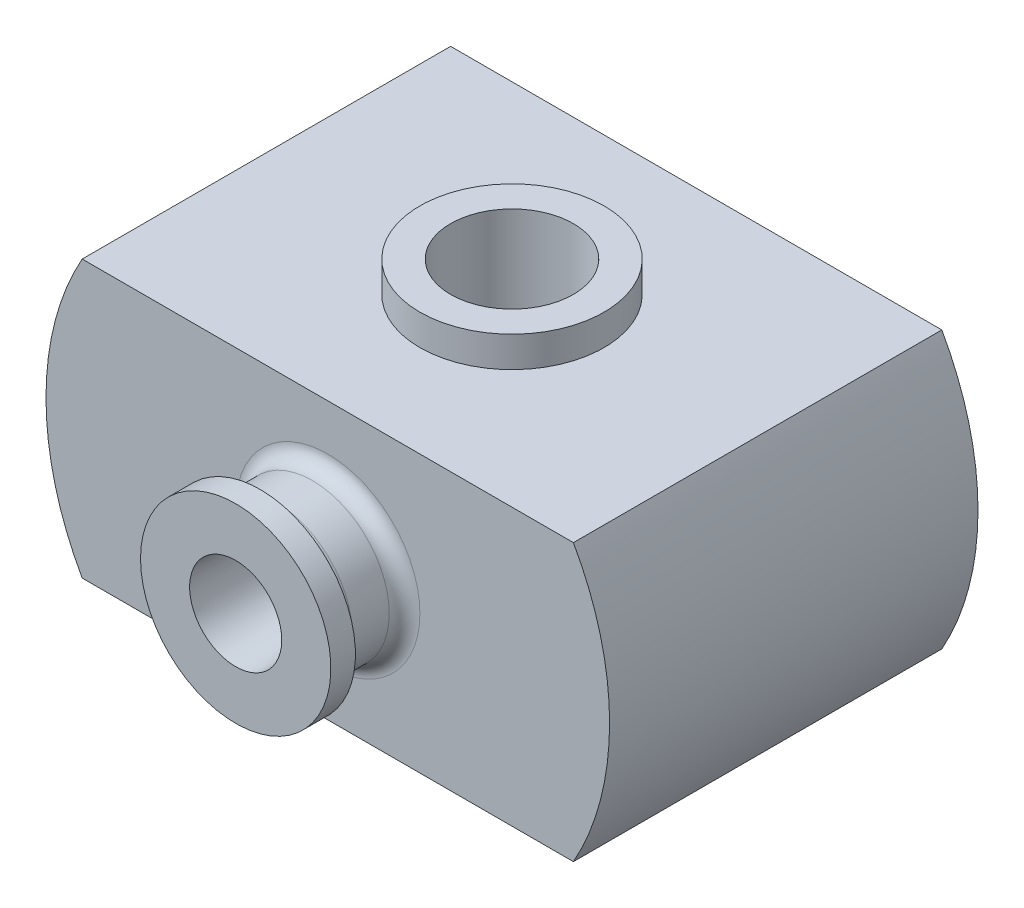
ISO-10303-21;
HEADER;
FILE_DESCRIPTION(('STEP AP214'),'2;1');
FILE_NAME('part.step','',(''),(''),'','','');
FILE_SCHEMA(('AUTOMOTIVE_DESIGN { 1 0 10303 214 1 1 1 1 }'));
ENDSEC;
DATA;
#1=APPLICATION_CONTEXT('core data for automotive mechanical design processes');
#2=APPLICATION_PROTOCOL_DEFINITION('international standard','automotive_design',2000,#1);
#3=PRODUCT_CONTEXT('',#1,'mechanical');
#4=PRODUCT('Part','Part','',(#3));
#5=PRODUCT_RELATED_PRODUCT_CATEGORY('part','',(#4));
#6=PRODUCT_DEFINITION_FORMATION('','',#4);
#7=PRODUCT_DEFINITION_CONTEXT('part definition',#1,'design');
#8=PRODUCT_DEFINITION('design','',#6,#7);
#9=PRODUCT_DEFINITION_SHAPE('','',#8);
#10=(LENGTH_UNIT() NAMED_UNIT(*) SI_UNIT(.MILLI.,.METRE.));
#11=(NAMED_UNIT(*) PLANE_ANGLE_UNIT() SI_UNIT($,.RADIAN.));
#12=(NAMED_UNIT(*) SI_UNIT($,.STERADIAN.) SOLID_ANGLE_UNIT());
#13=UNCERTAINTY_MEASURE_WITH_UNIT(LENGTH_MEASURE(1.E-05),#10,'distance_accuracy_value','');
#14=(GEOMETRIC_REPRESENTATION_CONTEXT(3) GLOBAL_UNCERTAINTY_ASSIGNED_CONTEXT((#13)) GLOBAL_UNIT_ASSIGNED_CONTEXT((#10,
#11,#12)) REPRESENTATION_CONTEXT('',''));
#15=CARTESIAN_POINT('',(0.,0.,0.));
#16=DIRECTION('',(0.,0.,1.));
#17=DIRECTION('',(1.,0.,0.));
#18=AXIS2_PLACEMENT_3D('',#15,#16,#17);
#19=CARTESIAN_POINT('',(-80.,45.,120.));
#20=DIRECTION('',(0.,-1.,0.));
#21=DIRECTION('',(0.,0.,-1.));
#22=AXIS2_PLACEMENT_3D('',#19,#20,#21);
#23=PLANE('',#22);
#24=DIRECTION('',(-1.,0.,0.));
#25=VECTOR('',#24,1.);
#26=CARTESIAN_POINT('',(-80.,45.,0.));
#27=LINE('',#26,#25);
#28=CARTESIAN_POINT('',(80.,45.,0.));
#29=VERTEX_POINT('',#28);
#30=CARTESIAN_POINT('',(-80.,45.,0.));
#31=VERTEX_POINT('',#30);
#32=EDGE_CURVE('E168',#29,#31,#27,.T.);
#33=ORIENTED_EDGE('',*,*,#32,.T.);
#34=DIRECTION('',(0.,0.,-1.));
#35=VECTOR('',#34,1.);
#36=CARTESIAN_POINT('',(-80.,45.,120.));
#37=LINE('',#36,#35);
#38=CARTESIAN_POINT('',(-80.,45.,120.));
#39=VERTEX_POINT('',#38);
#40=EDGE_CURVE('E176',#39,#31,#37,.T.);
#41=ORIENTED_EDGE('',*,*,#40,.F.);
#42=DIRECTION('',(-1.,0.,0.));
#43=VECTOR('',#42,1.);
#44=CARTESIAN_POINT('',(-80.,45.,120.));
#45=LINE('',#44,#43);
#46=CARTESIAN_POINT('',(80.,45.,120.));
#47=VERTEX_POINT('',#46);
#48=EDGE_CURVE('E93',#47,#39,#45,.T.);
#49=ORIENTED_EDGE('',*,*,#48,.F.);
#50=DIRECTION('',(0.,0.,-1.));
#51=VECTOR('',#50,1.);
#52=CARTESIAN_POINT('',(80.,45.,120.));
#53=LINE('',#52,#51);
#54=EDGE_CURVE('E179',#47,#29,#53,.T.);
#55=ORIENTED_EDGE('',*,*,#54,.T.);
#56=EDGE_LOOP('',(#33,#41,#49,#55));
#57=FACE_BOUND('',#56,.T.);
#58=CARTESIAN_POINT('',(0.,45.,60.));
#59=DIRECTION('',(0.,-1.,0.));
#60=DIRECTION('',(0.,0.,-1.));
#61=AXIS2_PLACEMENT_3D('',#58,#59,#60);
#62=CIRCLE('',#61,30.);
#63=CARTESIAN_POINT('',(0.,45.,30.));
#64=VERTEX_POINT('',#63);
#65=EDGE_CURVE('E142',#64,#64,#62,.F.);
#66=ORIENTED_EDGE('',*,*,#65,.F.);
#67=EDGE_LOOP('',(#66));
#68=FACE_BOUND('',#67,.T.);
#69=ADVANCED_FACE('F40',(#57,#68),#23,.F.);
#70=CARTESIAN_POINT('',(60.,30.,114.));
#71=DIRECTION('',(0.,1.,0.));
#72=DIRECTION('',(-1.,0.,0.));
#73=AXIS2_PLACEMENT_3D('',#70,#71,#72);
#74=PLANE('',#73);
#75=DIRECTION('',(1.,0.,0.));
#76=VECTOR('',#75,1.);
#77=CARTESIAN_POINT('',(60.,30.,0.));
#78=LINE('',#77,#76);
#79=CARTESIAN_POINT('',(-60.,30.,0.));
#80=VERTEX_POINT('',#79);
#81=CARTESIAN_POINT('',(60.,30.,0.));
#82=VERTEX_POINT('',#81);
#83=EDGE_CURVE('E148',#80,#82,#78,.T.);
#84=ORIENTED_EDGE('',*,*,#83,.T.);
#85=DIRECTION('',(0.,0.,-1.));
#86=VECTOR('',#85,1.);
#87=CARTESIAN_POINT('',(60.,30.,114.));
#88=LINE('',#87,#86);
#89=CARTESIAN_POINT('',(60.,30.,114.));
#90=VERTEX_POINT('',#89);
#91=EDGE_CURVE('E122',#90,#82,#88,.T.);
#92=ORIENTED_EDGE('',*,*,#91,.F.);
#93=DIRECTION('',(1.,0.,0.));
#94=VECTOR('',#93,1.);
#95=CARTESIAN_POINT('',(60.,30.,114.));
#96=LINE('',#95,#94);
#97=CARTESIAN_POINT('',(-60.,30.,114.));
#98=VERTEX_POINT('',#97);
#99=EDGE_CURVE('E126',#98,#90,#96,.T.);
#100=ORIENTED_EDGE('',*,*,#99,.F.);
#101=DIRECTION('',(0.,0.,-1.));
#102=VECTOR('',#101,1.);
#103=CARTESIAN_POINT('',(-60.,30.,114.));
#104=LINE('',#103,#102);
#105=EDGE_CURVE('E113',#98,#80,#104,.T.);
#106=ORIENTED_EDGE('',*,*,#105,.T.);
#107=EDGE_LOOP('',(#84,#92,#100,#106));
#108=FACE_BOUND('',#107,.T.);
#109=CARTESIAN_POINT('',(0.,30.,60.));
#110=DIRECTION('',(0.,1.,0.));
#111=DIRECTION('',(-1.,0.,0.));
#112=AXIS2_PLACEMENT_3D('',#109,#110,#111);
#113=CIRCLE('',#112,30.);
#114=CARTESIAN_POINT('',(-30.,30.,60.));
#115=VERTEX_POINT('',#114);
#116=EDGE_CURVE('E181',#115,#115,#113,.F.);
#117=ORIENTED_EDGE('',*,*,#116,.F.);
#118=EDGE_LOOP('',(#117));
#119=FACE_BOUND('',#118,.T.);
#120=ADVANCED_FACE('F127',(#108,#119),#74,.F.);
#121=CARTESIAN_POINT('',(0.,0.,120.));
#122=DIRECTION('',(0.,0.,-1.));
#123=DIRECTION('',(-1.,0.,0.));
#124=AXIS2_PLACEMENT_3D('',#121,#122,#123);
#125=CYLINDRICAL_SURFACE('',#124,91.7877987534291);
#126=CARTESIAN_POINT('',(0.,0.,0.));
#127=DIRECTION('',(0.,0.,1.));
#128=DIRECTION('',(1.,0.,0.));
#129=AXIS2_PLACEMENT_3D('',#126,#127,#128);
#130=CIRCLE('',#129,91.7877987534291);
#131=CARTESIAN_POINT('',(80.,-45.,0.));
#132=VERTEX_POINT('',#131);
#133=EDGE_CURVE('E155',#132,#29,#130,.T.);
#134=ORIENTED_EDGE('',*,*,#133,.T.);
#135=ORIENTED_EDGE('',*,*,#54,.F.);
#136=CARTESIAN_POINT('',(0.,0.,120.));
#137=DIRECTION('',(0.,0.,1.));
#138=DIRECTION('',(1.,0.,0.));
#139=AXIS2_PLACEMENT_3D('',#136,#137,#138);
#140=CIRCLE('',#139,91.7877987534291);
#141=CARTESIAN_POINT('',(80.,-45.,120.));
#142=VERTEX_POINT('',#141);
#143=EDGE_CURVE('E159',#142,#47,#140,.T.);
#144=ORIENTED_EDGE('',*,*,#143,.F.);
#145=DIRECTION('',(0.,0.,-1.));
#146=VECTOR('',#145,1.);
#147=CARTESIAN_POINT('',(80.,-45.,120.));
#148=LINE('',#147,#146);
#149=EDGE_CURVE('E165',#142,#132,#148,.T.);
#150=ORIENTED_EDGE('',*,*,#149,.T.);
#151=EDGE_LOOP('',(#134,#135,#144,#150));
#152=FACE_BOUND('',#151,.T.);
#153=ADVANCED_FACE('F221',(#152),#125,.T.);
#154=CARTESIAN_POINT('',(0.,0.,120.));
#155=DIRECTION('',(0.,0.,-1.));
#156=DIRECTION('',(-1.,0.,0.));
#157=AXIS2_PLACEMENT_3D('',#154,#155,#156);
#158=CYLINDRICAL_SURFACE('',#157,91.7877987534291);
#159=CARTESIAN_POINT('',(0.,0.,0.));
#160=DIRECTION('',(0.,0.,1.));
#161=DIRECTION('',(1.,0.,0.));
#162=AXIS2_PLACEMENT_3D('',#159,#160,#161);
#163=CIRCLE('',#162,91.7877987534291);
#164=CARTESIAN_POINT('',(-80.,-45.,0.));
#165=VERTEX_POINT('',#164);
#166=EDGE_CURVE('E170',#31,#165,#163,.T.);
#167=ORIENTED_EDGE('',*,*,#166,.T.);
#168=DIRECTION('',(0.,0.,-1.));
#169=VECTOR('',#168,1.);
#170=CARTESIAN_POINT('',(-80.,-45.,120.));
#171=LINE('',#170,#169);
#172=CARTESIAN_POINT('',(-80.,-45.,120.));
#173=VERTEX_POINT('',#172);
#174=EDGE_CURVE('E174',#173,#165,#171,.T.);
#175=ORIENTED_EDGE('',*,*,#174,.F.);
#176=CARTESIAN_POINT('',(0.,0.,120.));
#177=DIRECTION('',(0.,0.,1.));
#178=DIRECTION('',(1.,0.,0.));
#179=AXIS2_PLACEMENT_3D('',#176,#177,#178);
#180=CIRCLE('',#179,91.7877987534291);
#181=EDGE_CURVE('E162',#39,#173,#180,.T.);
#182=ORIENTED_EDGE('',*,*,#181,.F.);
#183=ORIENTED_EDGE('',*,*,#40,.T.);
#184=EDGE_LOOP('',(#167,#175,#182,#183));
#185=FACE_BOUND('',#184,.T.);
#186=ADVANCED_FACE('F226',(#185),#158,.T.);
#187=CARTESIAN_POINT('',(-80.,-45.,120.));
#188=DIRECTION('',(0.,1.,0.));
#189=DIRECTION('',(0.,0.,1.));
#190=AXIS2_PLACEMENT_3D('',#187,#188,#189);
#191=PLANE('',#190);
#192=CARTESIAN_POINT('',(0.,-45.,60.));
#193=DIRECTION('',(0.,1.,0.));
#194=DIRECTION('',(0.,0.,1.));
#195=AXIS2_PLACEMENT_3D('',#192,#193,#194);
#196=CIRCLE('',#195,30.);
#197=CARTESIAN_POINT('',(0.,-45.,90.));
#198=VERTEX_POINT('',#197);
#199=EDGE_CURVE('E187',#198,#198,#196,.T.);
#200=ORIENTED_EDGE('',*,*,#199,.T.);
#201=EDGE_LOOP('',(#200));
#202=FACE_BOUND('',#201,.T.);
#203=DIRECTION('',(1.,0.,0.));
#204=VECTOR('',#203,1.);
#205=CARTESIAN_POINT('',(-80.,-45.,0.));
#206=LINE('',#205,#204);
#207=EDGE_CURVE('E85',#165,#132,#206,.T.);
#208=ORIENTED_EDGE('',*,*,#207,.T.);
#209=ORIENTED_EDGE('',*,*,#149,.F.);
#210=DIRECTION('',(1.,0.,0.));
#211=VECTOR('',#210,1.);
#212=CARTESIAN_POINT('',(-80.,-45.,120.));
#213=LINE('',#212,#211);
#214=EDGE_CURVE('E64',#173,#142,#213,.T.);
#215=ORIENTED_EDGE('',*,*,#214,.F.);
#216=ORIENTED_EDGE('',*,*,#174,.T.);
#217=EDGE_LOOP('',(#208,#209,#215,#216));
#218=FACE_BOUND('',#217,.T.);
#219=ADVANCED_FACE('F233',(#202,#218),#191,.F.);
#220=CARTESIAN_POINT('',(0.,0.,120.));
#221=DIRECTION('',(0.,0.,1.));
#222=DIRECTION('',(1.,0.,0.));
#223=AXIS2_PLACEMENT_3D('',#220,#221,#222);
#224=PLANE('',#223);
#225=CARTESIAN_POINT('',(0.,0.,120.));
#226=DIRECTION('',(0.,0.,1.));
#227=DIRECTION('',(1.,0.,0.));
#228=AXIS2_PLACEMENT_3D('',#225,#226,#227);
#229=CIRCLE('',#228,30.);
#230=CARTESIAN_POINT('',(30.,0.,120.));
#231=VERTEX_POINT('',#230);
#232=EDGE_CURVE('E189',#231,#231,#229,.F.);
#233=ORIENTED_EDGE('',*,*,#232,.T.);
#234=EDGE_LOOP('',(#233));
#235=FACE_BOUND('',#234,.T.);
#236=ORIENTED_EDGE('',*,*,#143,.T.);
#237=ORIENTED_EDGE('',*,*,#48,.T.);
#238=ORIENTED_EDGE('',*,*,#181,.T.);
#239=ORIENTED_EDGE('',*,*,#214,.T.);
#240=EDGE_LOOP('',(#236,#237,#238,#239));
#241=FACE_BOUND('',#240,.T.);
#242=ADVANCED_FACE('F243',(#235,#241),#224,.T.);
#243=CARTESIAN_POINT('',(0.,0.,0.));
#244=DIRECTION('',(0.,0.,1.));
#245=DIRECTION('',(1.,0.,0.));
#246=AXIS2_PLACEMENT_3D('',#243,#244,#245);
#247=PLANE('',#246);
#248=ORIENTED_EDGE('',*,*,#83,.F.);
#249=CARTESIAN_POINT('',(0.,0.,0.));
#250=DIRECTION('',(0.,0.,-1.));
#251=DIRECTION('',(-1.,0.,0.));
#252=AXIS2_PLACEMENT_3D('',#249,#250,#251);
#253=CIRCLE('',#252,67.0820393249937);
#254=CARTESIAN_POINT('',(-60.,-30.,0.));
#255=VERTEX_POINT('',#254);
#256=EDGE_CURVE('E55',#255,#80,#253,.T.);
#257=ORIENTED_EDGE('',*,*,#256,.F.);
#258=DIRECTION('',(-1.,0.,0.));
#259=VECTOR('',#258,1.);
#260=CARTESIAN_POINT('',(60.,-30.,0.));
#261=LINE('',#260,#259);
#262=CARTESIAN_POINT('',(60.,-30.,0.));
#263=VERTEX_POINT('',#262);
#264=EDGE_CURVE('E136',#263,#255,#261,.T.);
#265=ORIENTED_EDGE('',*,*,#264,.F.);
#266=CARTESIAN_POINT('',(0.,0.,0.));
#267=DIRECTION('',(0.,0.,-1.));
#268=DIRECTION('',(-1.,0.,0.));
#269=AXIS2_PLACEMENT_3D('',#266,#267,#268);
#270=CIRCLE('',#269,67.0820393249937);
#271=EDGE_CURVE('E139',#82,#263,#270,.T.);
#272=ORIENTED_EDGE('',*,*,#271,.F.);
#273=EDGE_LOOP('',(#248,#257,#265,#272));
#274=FACE_BOUND('',#273,.T.);
#275=ORIENTED_EDGE('',*,*,#133,.F.);
#276=ORIENTED_EDGE('',*,*,#207,.F.);
#277=ORIENTED_EDGE('',*,*,#166,.F.);
#278=ORIENTED_EDGE('',*,*,#32,.F.);
#279=EDGE_LOOP('',(#275,#276,#277,#278));
#280=FACE_BOUND('',#279,.T.);
#281=ADVANCED_FACE('F239',(#274,#280),#247,.F.);
#282=CARTESIAN_POINT('',(0.,0.,114.));
#283=DIRECTION('',(0.,0.,-1.));
#284=DIRECTION('',(-1.,0.,0.));
#285=AXIS2_PLACEMENT_3D('',#282,#283,#284);
#286=CYLINDRICAL_SURFACE('',#285,67.0820393249937);
#287=ORIENTED_EDGE('',*,*,#256,.T.);
#288=ORIENTED_EDGE('',*,*,#105,.F.);
#289=CARTESIAN_POINT('',(0.,0.,114.));
#290=DIRECTION('',(0.,0.,-1.));
#291=DIRECTION('',(-1.,0.,0.));
#292=AXIS2_PLACEMENT_3D('',#289,#290,#291);
#293=CIRCLE('',#292,67.0820393249937);
#294=CARTESIAN_POINT('',(-60.,-30.,114.));
#295=VERTEX_POINT('',#294);
#296=EDGE_CURVE('E117',#295,#98,#293,.T.);
#297=ORIENTED_EDGE('',*,*,#296,.F.);
#298=DIRECTION('',(0.,0.,-1.));
#299=VECTOR('',#298,1.);
#300=CARTESIAN_POINT('',(-60.,-30.,114.));
#301=LINE('',#300,#299);
#302=EDGE_CURVE('E153',#295,#255,#301,.T.);
#303=ORIENTED_EDGE('',*,*,#302,.T.);
#304=EDGE_LOOP('',(#287,#288,#297,#303));
#305=FACE_BOUND('',#304,.T.);
#306=ADVANCED_FACE('F115',(#305),#286,.F.);
#307=CARTESIAN_POINT('',(60.,-30.,114.));
#308=DIRECTION('',(0.,-1.,0.));
#309=DIRECTION('',(0.,0.,-1.));
#310=AXIS2_PLACEMENT_3D('',#307,#308,#309);
#311=PLANE('',#310);
#312=CARTESIAN_POINT('',(0.,-30.,60.));
#313=DIRECTION('',(0.,-1.,0.));
#314=DIRECTION('',(0.,0.,-1.));
#315=AXIS2_PLACEMENT_3D('',#312,#313,#314);
#316=CIRCLE('',#315,30.);
#317=CARTESIAN_POINT('',(0.,-30.,30.));
#318=VERTEX_POINT('',#317);
#319=EDGE_CURVE('E184',#318,#318,#316,.T.);
#320=ORIENTED_EDGE('',*,*,#319,.T.);
#321=EDGE_LOOP('',(#320));
#322=FACE_BOUND('',#321,.T.);
#323=ORIENTED_EDGE('',*,*,#264,.T.);
#324=ORIENTED_EDGE('',*,*,#302,.F.);
#325=DIRECTION('',(-1.,0.,0.));
#326=VECTOR('',#325,1.);
#327=CARTESIAN_POINT('',(60.,-30.,114.));
#328=LINE('',#327,#326);
#329=CARTESIAN_POINT('',(60.,-30.,114.));
#330=VERTEX_POINT('',#329);
#331=EDGE_CURVE('E123',#330,#295,#328,.T.);
#332=ORIENTED_EDGE('',*,*,#331,.F.);
#333=DIRECTION('',(0.,0.,-1.));
#334=VECTOR('',#333,1.);
#335=CARTESIAN_POINT('',(60.,-30.,114.));
#336=LINE('',#335,#334);
#337=EDGE_CURVE('E156',#330,#263,#336,.T.);
#338=ORIENTED_EDGE('',*,*,#337,.T.);
#339=EDGE_LOOP('',(#323,#324,#332,#338));
#340=FACE_BOUND('',#339,.T.);
#341=ADVANCED_FACE('F257',(#322,#340),#311,.F.);
#342=CARTESIAN_POINT('',(0.,0.,114.));
#343=DIRECTION('',(0.,0.,-1.));
#344=DIRECTION('',(-1.,0.,0.));
#345=AXIS2_PLACEMENT_3D('',#342,#343,#344);
#346=CYLINDRICAL_SURFACE('',#345,67.0820393249937);
#347=ORIENTED_EDGE('',*,*,#271,.T.);
#348=ORIENTED_EDGE('',*,*,#337,.F.);
#349=CARTESIAN_POINT('',(0.,0.,114.));
#350=DIRECTION('',(0.,0.,-1.));
#351=DIRECTION('',(-1.,0.,0.));
#352=AXIS2_PLACEMENT_3D('',#349,#350,#351);
#353=CIRCLE('',#352,67.0820393249937);
#354=EDGE_CURVE('E132',#90,#330,#353,.T.);
#355=ORIENTED_EDGE('',*,*,#354,.F.);
#356=ORIENTED_EDGE('',*,*,#91,.T.);
#357=EDGE_LOOP('',(#347,#348,#355,#356));
#358=FACE_BOUND('',#357,.T.);
#359=ADVANCED_FACE('F259',(#358),#346,.F.);
#360=CARTESIAN_POINT('',(0.,0.,114.));
#361=DIRECTION('',(0.,0.,-1.));
#362=DIRECTION('',(-1.,0.,0.));
#363=AXIS2_PLACEMENT_3D('',#360,#361,#362);
#364=PLANE('',#363);
#365=CARTESIAN_POINT('',(0.,0.,114.));
#366=DIRECTION('',(0.,0.,-1.));
#367=DIRECTION('',(-1.,0.,0.));
#368=AXIS2_PLACEMENT_3D('',#365,#366,#367);
#369=CIRCLE('',#368,13.);
#370=CARTESIAN_POINT('',(-13.,0.,114.));
#371=VERTEX_POINT('',#370);
#372=EDGE_CURVE('E318',#371,#371,#369,.F.);
#373=ORIENTED_EDGE('',*,*,#372,.T.);
#374=EDGE_LOOP('',(#373));
#375=FACE_BOUND('',#374,.T.);
#376=ORIENTED_EDGE('',*,*,#296,.T.);
#377=ORIENTED_EDGE('',*,*,#99,.T.);
#378=ORIENTED_EDGE('',*,*,#354,.T.);
#379=ORIENTED_EDGE('',*,*,#331,.T.);
#380=EDGE_LOOP('',(#376,#377,#378,#379));
#381=FACE_BOUND('',#380,.T.);
#382=ADVANCED_FACE('F134',(#375,#381),#364,.T.);
#383=CARTESIAN_POINT('',(0.,55.,60.));
#384=DIRECTION('',(0.,-1.,0.));
#385=DIRECTION('',(0.,0.,-1.));
#386=AXIS2_PLACEMENT_3D('',#383,#384,#385);
#387=CYLINDRICAL_SURFACE('',#386,30.);
#388=CARTESIAN_POINT('',(0.,25.,60.));
#389=DIRECTION('',(0.,1.,0.));
#390=DIRECTION('',(0.,0.,1.));
#391=AXIS2_PLACEMENT_3D('',#388,#389,#390);
#392=CIRCLE('',#391,30.);
#393=CARTESIAN_POINT('',(0.,25.,90.));
#394=VERTEX_POINT('',#393);
#395=EDGE_CURVE('E343',#394,#394,#392,.T.);
#396=ORIENTED_EDGE('',*,*,#395,.T.);
#397=EDGE_LOOP('',(#396));
#398=FACE_BOUND('',#397,.T.);
#399=ORIENTED_EDGE('',*,*,#116,.T.);
#400=EDGE_LOOP('',(#399));
#401=FACE_BOUND('',#400,.T.);
#402=ADVANCED_FACE('F266',(#398,#401),#387,.T.);
#403=CARTESIAN_POINT('',(0.,25.,60.));
#404=DIRECTION('',(0.,1.,0.));
#405=DIRECTION('',(0.,0.,1.));
#406=AXIS2_PLACEMENT_3D('',#403,#404,#405);
#407=PLANE('',#406);
#408=ORIENTED_EDGE('',*,*,#395,.F.);
#409=EDGE_LOOP('',(#408));
#410=FACE_BOUND('',#409,.T.);
#411=CARTESIAN_POINT('',(0.,25.,60.));
#412=DIRECTION('',(0.,1.,0.));
#413=DIRECTION('',(0.,0.,1.));
#414=AXIS2_PLACEMENT_3D('',#411,#412,#413);
#415=CIRCLE('',#414,20.);
#416=CARTESIAN_POINT('',(0.,25.,80.));
#417=VERTEX_POINT('',#416);
#418=EDGE_CURVE('E339',#417,#417,#415,.T.);
#419=ORIENTED_EDGE('',*,*,#418,.T.);
#420=EDGE_LOOP('',(#419));
#421=FACE_BOUND('',#420,.T.);
#422=ADVANCED_FACE('F280',(#410,#421),#407,.F.);
#423=CARTESIAN_POINT('',(0.,45.,60.));
#424=DIRECTION('',(0.,-1.,0.));
#425=DIRECTION('',(0.,0.,-1.));
#426=AXIS2_PLACEMENT_3D('',#423,#424,#425);
#427=CYLINDRICAL_SURFACE('',#426,20.);
#428=ORIENTED_EDGE('',*,*,#418,.F.);
#429=EDGE_LOOP('',(#428));
#430=FACE_BOUND('',#429,.T.);
#431=CARTESIAN_POINT('',(0.,55.,60.));
#432=DIRECTION('',(0.,1.,0.));
#433=DIRECTION('',(0.,0.,1.));
#434=AXIS2_PLACEMENT_3D('',#431,#432,#433);
#435=CIRCLE('',#434,20.);
#436=CARTESIAN_POINT('',(0.,55.,80.));
#437=VERTEX_POINT('',#436);
#438=EDGE_CURVE('E340',#437,#437,#435,.T.);
#439=ORIENTED_EDGE('',*,*,#438,.T.);
#440=EDGE_LOOP('',(#439));
#441=FACE_BOUND('',#440,.T.);
#442=ADVANCED_FACE('F274',(#430,#441),#427,.F.);
#443=CARTESIAN_POINT('',(0.,55.,60.));
#444=DIRECTION('',(0.,1.,0.));
#445=DIRECTION('',(0.,0.,1.));
#446=AXIS2_PLACEMENT_3D('',#443,#444,#445);
#447=CIRCLE('',#446,30.);
#448=CARTESIAN_POINT('',(0.,55.,90.));
#449=VERTEX_POINT('',#448);
#450=EDGE_CURVE('E149',#449,#449,#447,.T.);
#451=ORIENTED_EDGE('',*,*,#450,.F.);
#452=EDGE_LOOP('',(#451));
#453=FACE_BOUND('',#452,.T.);
#454=ORIENTED_EDGE('',*,*,#65,.T.);
#455=EDGE_LOOP('',(#454));
#456=FACE_BOUND('',#455,.T.);
#457=ADVANCED_FACE('F275',(#453,#456),#387,.T.);
#458=CARTESIAN_POINT('',(0.,55.,60.));
#459=DIRECTION('',(0.,1.,0.));
#460=DIRECTION('',(0.,0.,1.));
#461=AXIS2_PLACEMENT_3D('',#458,#459,#460);
#462=PLANE('',#461);
#463=ORIENTED_EDGE('',*,*,#450,.T.);
#464=EDGE_LOOP('',(#463));
#465=FACE_BOUND('',#464,.T.);
#466=ORIENTED_EDGE('',*,*,#438,.F.);
#467=EDGE_LOOP('',(#466));
#468=FACE_BOUND('',#467,.T.);
#469=ADVANCED_FACE('F278',(#465,#468),#462,.T.);
#470=CARTESIAN_POINT('',(0.,-55.,60.));
#471=DIRECTION('',(0.,1.,0.));
#472=DIRECTION('',(0.,0.,1.));
#473=AXIS2_PLACEMENT_3D('',#470,#471,#472);
#474=CYLINDRICAL_SURFACE('',#473,30.);
#475=CARTESIAN_POINT('',(0.,-25.,60.));
#476=DIRECTION('',(0.,1.,0.));
#477=DIRECTION('',(0.,0.,1.));
#478=AXIS2_PLACEMENT_3D('',#475,#476,#477);
#479=CIRCLE('',#478,30.);
#480=CARTESIAN_POINT('',(0.,-25.,90.));
#481=VERTEX_POINT('',#480);
#482=EDGE_CURVE('E330',#481,#481,#479,.T.);
#483=ORIENTED_EDGE('',*,*,#482,.F.);
#484=EDGE_LOOP('',(#483));
#485=FACE_BOUND('',#484,.T.);
#486=ORIENTED_EDGE('',*,*,#319,.F.);
#487=EDGE_LOOP('',(#486));
#488=FACE_BOUND('',#487,.T.);
#489=ADVANCED_FACE('F286',(#485,#488),#474,.T.);
#490=CARTESIAN_POINT('',(0.,-25.,60.));
#491=DIRECTION('',(0.,-1.,0.));
#492=DIRECTION('',(0.,0.,1.));
#493=AXIS2_PLACEMENT_3D('',#490,#491,#492);
#494=PLANE('',#493);
#495=CARTESIAN_POINT('',(0.,-25.,60.));
#496=DIRECTION('',(0.,1.,0.));
#497=DIRECTION('',(0.,0.,1.));
#498=AXIS2_PLACEMENT_3D('',#495,#496,#497);
#499=CIRCLE('',#498,20.);
#500=CARTESIAN_POINT('',(0.,-25.,80.));
#501=VERTEX_POINT('',#500);
#502=EDGE_CURVE('E321',#501,#501,#499,.T.);
#503=ORIENTED_EDGE('',*,*,#502,.F.);
#504=EDGE_LOOP('',(#503));
#505=FACE_BOUND('',#504,.T.);
#506=ORIENTED_EDGE('',*,*,#482,.T.);
#507=EDGE_LOOP('',(#506));
#508=FACE_BOUND('',#507,.T.);
#509=ADVANCED_FACE('F272',(#505,#508),#494,.F.);
#510=ORIENTED_EDGE('',*,*,#502,.T.);
#511=EDGE_LOOP('',(#510));
#512=FACE_BOUND('',#511,.T.);
#513=CARTESIAN_POINT('',(0.,-55.,60.));
#514=DIRECTION('',(0.,1.,0.));
#515=DIRECTION('',(0.,0.,1.));
#516=AXIS2_PLACEMENT_3D('',#513,#514,#515);
#517=CIRCLE('',#516,20.);
#518=CARTESIAN_POINT('',(0.,-55.,80.));
#519=VERTEX_POINT('',#518);
#520=EDGE_CURVE('E327',#519,#519,#517,.T.);
#521=ORIENTED_EDGE('',*,*,#520,.F.);
#522=EDGE_LOOP('',(#521));
#523=FACE_BOUND('',#522,.T.);
#524=ADVANCED_FACE('F268',(#512,#523),#427,.F.);
#525=CARTESIAN_POINT('',(0.,-55.,60.));
#526=DIRECTION('',(0.,1.,0.));
#527=DIRECTION('',(0.,0.,1.));
#528=AXIS2_PLACEMENT_3D('',#525,#526,#527);
#529=CIRCLE('',#528,30.);
#530=CARTESIAN_POINT('',(0.,-55.,90.));
#531=VERTEX_POINT('',#530);
#532=EDGE_CURVE('E188',#531,#531,#529,.T.);
#533=ORIENTED_EDGE('',*,*,#532,.T.);
#534=EDGE_LOOP('',(#533));
#535=FACE_BOUND('',#534,.T.);
#536=ORIENTED_EDGE('',*,*,#199,.F.);
#537=EDGE_LOOP('',(#536));
#538=FACE_BOUND('',#537,.T.);
#539=ADVANCED_FACE('F271',(#535,#538),#474,.T.);
#540=CARTESIAN_POINT('',(0.,-55.,60.));
#541=DIRECTION('',(0.,-1.,0.));
#542=DIRECTION('',(0.,0.,1.));
#543=AXIS2_PLACEMENT_3D('',#540,#541,#542);
#544=PLANE('',#543);
#545=ORIENTED_EDGE('',*,*,#520,.T.);
#546=EDGE_LOOP('',(#545));
#547=FACE_BOUND('',#546,.T.);
#548=ORIENTED_EDGE('',*,*,#532,.F.);
#549=EDGE_LOOP('',(#548));
#550=FACE_BOUND('',#549,.T.);
#551=ADVANCED_FACE('F290',(#547,#550),#544,.T.);
#552=CARTESIAN_POINT('',(0.,0.,-35.7058861543779));
#553=DIRECTION('',(0.,0.,-1.));
#554=DIRECTION('',(-1.,0.,0.));
#555=AXIS2_PLACEMENT_3D('',#552,#553,#554);
#556=CYLINDRICAL_SURFACE('',#555,25.);
#557=CARTESIAN_POINT('',(0.,0.,137.));
#558=DIRECTION('',(0.,0.,-1.));
#559=DIRECTION('',(-1.,0.,0.));
#560=AXIS2_PLACEMENT_3D('',#557,#558,#559);
#561=CIRCLE('',#560,25.);
#562=CARTESIAN_POINT('',(-25.,0.,137.));
#563=VERTEX_POINT('',#562);
#564=EDGE_CURVE('E48',#563,#563,#561,.T.);
#565=ORIENTED_EDGE('',*,*,#564,.T.);
#566=EDGE_LOOP('',(#565));
#567=FACE_BOUND('',#566,.T.);
#568=CARTESIAN_POINT('',(0.,0.,125.));
#569=DIRECTION('',(0.,0.,1.));
#570=DIRECTION('',(1.,0.,0.));
#571=AXIS2_PLACEMENT_3D('',#568,#569,#570);
#572=CIRCLE('',#571,25.);
#573=CARTESIAN_POINT('',(25.,0.,125.));
#574=VERTEX_POINT('',#573);
#575=EDGE_CURVE('E192',#574,#574,#572,.T.);
#576=ORIENTED_EDGE('',*,*,#575,.T.);
#577=EDGE_LOOP('',(#576));
#578=FACE_BOUND('',#577,.T.);
#579=ADVANCED_FACE('F197',(#567,#578),#556,.T.);
#580=CARTESIAN_POINT('',(-25.,0.,142.));
#581=DIRECTION('',(0.,0.,-1.));
#582=DIRECTION('',(-1.,0.,0.));
#583=AXIS2_PLACEMENT_3D('',#580,#581,#582);
#584=PLANE('',#583);
#585=CARTESIAN_POINT('',(0.,0.,142.));
#586=DIRECTION('',(0.,0.,-1.));
#587=DIRECTION('',(-1.,0.,0.));
#588=AXIS2_PLACEMENT_3D('',#585,#586,#587);
#589=CIRCLE('',#588,30.);
#590=CARTESIAN_POINT('',(-30.,0.,142.));
#591=VERTEX_POINT('',#590);
#592=EDGE_CURVE('E11',#591,#591,#589,.F.);
#593=ORIENTED_EDGE('',*,*,#592,.T.);
#594=EDGE_LOOP('',(#593));
#595=FACE_BOUND('',#594,.T.);
#596=CARTESIAN_POINT('',(0.,0.,142.));
#597=DIRECTION('',(0.,0.,-1.));
#598=DIRECTION('',(-1.,0.,0.));
#599=AXIS2_PLACEMENT_3D('',#596,#597,#598);
#600=CIRCLE('',#599,31.);
#601=CARTESIAN_POINT('',(-31.,0.,142.));
#602=VERTEX_POINT('',#601);
#603=EDGE_CURVE('E317',#602,#602,#600,.T.);
#604=ORIENTED_EDGE('',*,*,#603,.T.);
#605=EDGE_LOOP('',(#604));
#606=FACE_BOUND('',#605,.T.);
#607=ADVANCED_FACE('F300',(#595,#606),#584,.T.);
#608=CARTESIAN_POINT('',(0.,0.,-35.7058861543779));
#609=DIRECTION('',(0.,0.,-1.));
#610=DIRECTION('',(-1.,0.,0.));
#611=AXIS2_PLACEMENT_3D('',#608,#609,#610);
#612=CYLINDRICAL_SURFACE('',#611,31.);
#613=CARTESIAN_POINT('',(0.,0.,150.));
#614=DIRECTION('',(0.,0.,-1.));
#615=DIRECTION('',(-1.,0.,0.));
#616=AXIS2_PLACEMENT_3D('',#613,#614,#615);
#617=CIRCLE('',#616,31.);
#618=CARTESIAN_POINT('',(-31.,0.,150.));
#619=VERTEX_POINT('',#618);
#620=EDGE_CURVE('E316',#619,#619,#617,.T.);
#621=ORIENTED_EDGE('',*,*,#620,.T.);
#622=EDGE_LOOP('',(#621));
#623=FACE_BOUND('',#622,.T.);
#624=ORIENTED_EDGE('',*,*,#603,.F.);
#625=EDGE_LOOP('',(#624));
#626=FACE_BOUND('',#625,.T.);
#627=ADVANCED_FACE('F302',(#623,#626),#612,.T.);
#628=CARTESIAN_POINT('',(-31.,0.,150.));
#629=DIRECTION('',(0.,0.,1.));
#630=DIRECTION('',(1.,0.,0.));
#631=AXIS2_PLACEMENT_3D('',#628,#629,#630);
#632=PLANE('',#631);
#633=CARTESIAN_POINT('',(0.,0.,150.));
#634=DIRECTION('',(0.,0.,1.));
#635=DIRECTION('',(1.,0.,0.));
#636=AXIS2_PLACEMENT_3D('',#633,#634,#635);
#637=CIRCLE('',#636,15.);
#638=CARTESIAN_POINT('',(15.,0.,150.));
#639=VERTEX_POINT('',#638);
#640=EDGE_CURVE('E313',#639,#639,#637,.T.);
#641=ORIENTED_EDGE('',*,*,#640,.F.);
#642=EDGE_LOOP('',(#641));
#643=FACE_BOUND('',#642,.T.);
#644=ORIENTED_EDGE('',*,*,#620,.F.);
#645=EDGE_LOOP('',(#644));
#646=FACE_BOUND('',#645,.T.);
#647=ADVANCED_FACE('F212',(#643,#646),#632,.T.);
#648=CARTESIAN_POINT('',(0.,0.,125.));
#649=DIRECTION('',(0.,0.,1.));
#650=DIRECTION('',(1.,0.,0.));
#651=AXIS2_PLACEMENT_3D('',#648,#649,#650);
#652=TOROIDAL_SURFACE('',#651,30.,5.);
#653=ORIENTED_EDGE('',*,*,#575,.F.);
#654=EDGE_LOOP('',(#653));
#655=FACE_BOUND('',#654,.T.);
#656=ORIENTED_EDGE('',*,*,#232,.F.);
#657=EDGE_LOOP('',(#656));
#658=FACE_BOUND('',#657,.T.);
#659=ADVANCED_FACE('F202',(#655,#658),#652,.F.);
#660=CARTESIAN_POINT('',(0.,0.,137.));
#661=DIRECTION('',(0.,0.,-1.));
#662=DIRECTION('',(-1.,0.,0.));
#663=AXIS2_PLACEMENT_3D('',#660,#661,#662);
#664=TOROIDAL_SURFACE('',#663,30.,5.);
#665=ORIENTED_EDGE('',*,*,#592,.F.);
#666=EDGE_LOOP('',(#665));
#667=FACE_BOUND('',#666,.T.);
#668=ORIENTED_EDGE('',*,*,#564,.F.);
#669=EDGE_LOOP('',(#668));
#670=FACE_BOUND('',#669,.T.);
#671=ADVANCED_FACE('F42',(#667,#670),#664,.F.);
#672=CARTESIAN_POINT('',(0.,0.,105.));
#673=DIRECTION('',(0.,0.,1.));
#674=DIRECTION('',(1.,0.,0.));
#675=AXIS2_PLACEMENT_3D('',#672,#673,#674);
#676=CONICAL_SURFACE('',#675,12.5,0.0554985052457168);
#677=ORIENTED_EDGE('',*,*,#372,.F.);
#678=EDGE_LOOP('',(#677));
#679=FACE_BOUND('',#678,.T.);
#680=ORIENTED_EDGE('',*,*,#640,.T.);
#681=EDGE_LOOP('',(#680));
#682=FACE_BOUND('',#681,.T.);
#683=ADVANCED_FACE('F201',(#679,#682),#676,.F.);
#684=CLOSED_SHELL('',(#69,#120,#153,#186,#219,#242,#281,#306,#341,#359,#382,#402,#422,#442,#457,
#469,#489,#509,#524,#539,#551,#579,#607,#627,#647,#659,#671,#683));
#685=MANIFOLD_SOLID_BREP('B2',#684);
#686=ADVANCED_BREP_SHAPE_REPRESENTATION('',(#18,#685),#14);
#687=SHAPE_DEFINITION_REPRESENTATION(#9,#686);
ENDSEC;
END-ISO-10303-21;
